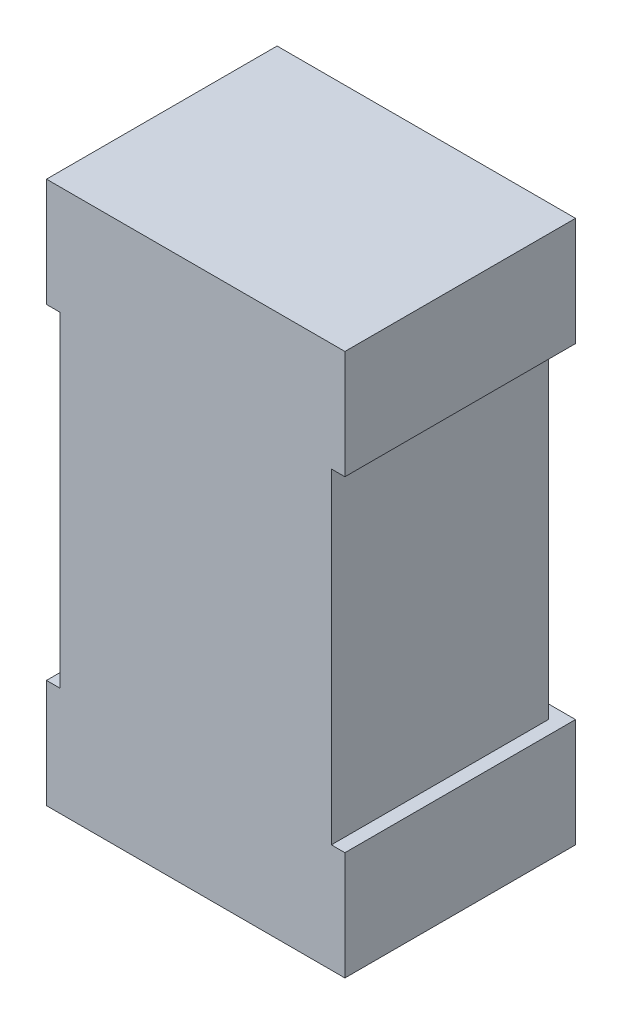
ISO-10303-21;
HEADER;
FILE_DESCRIPTION(('STEP AP214'),'2;1');
FILE_NAME('part.step','',(''),(''),'','','');
FILE_SCHEMA(('AUTOMOTIVE_DESIGN { 1 0 10303 214 1 1 1 1 }'));
ENDSEC;
DATA;
#1=APPLICATION_CONTEXT('core data for automotive mechanical design processes');
#2=APPLICATION_PROTOCOL_DEFINITION('international standard','automotive_design',2000,#1);
#3=PRODUCT_CONTEXT('',#1,'mechanical');
#4=PRODUCT('Part','Part','',(#3));
#5=PRODUCT_RELATED_PRODUCT_CATEGORY('part','',(#4));
#6=PRODUCT_DEFINITION_FORMATION('','',#4);
#7=PRODUCT_DEFINITION_CONTEXT('part definition',#1,'design');
#8=PRODUCT_DEFINITION('design','',#6,#7);
#9=PRODUCT_DEFINITION_SHAPE('','',#8);
#10=(LENGTH_UNIT() NAMED_UNIT(*) SI_UNIT(.MILLI.,.METRE.));
#11=(NAMED_UNIT(*) PLANE_ANGLE_UNIT() SI_UNIT($,.RADIAN.));
#12=(NAMED_UNIT(*) SI_UNIT($,.STERADIAN.) SOLID_ANGLE_UNIT());
#13=UNCERTAINTY_MEASURE_WITH_UNIT(LENGTH_MEASURE(1.E-05),#10,'distance_accuracy_value','');
#14=(GEOMETRIC_REPRESENTATION_CONTEXT(3) GLOBAL_UNCERTAINTY_ASSIGNED_CONTEXT((#13)) GLOBAL_UNIT_ASSIGNED_CONTEXT((#10,
#11,#12)) REPRESENTATION_CONTEXT('',''));
#15=CARTESIAN_POINT('',(0.,0.,0.));
#16=DIRECTION('',(0.,0.,1.));
#17=DIRECTION('',(1.,0.,0.));
#18=AXIS2_PLACEMENT_3D('',#15,#16,#17);
#19=CARTESIAN_POINT('',(5.149,2.401,-7.85));
#20=DIRECTION('',(0.,0.,-1.));
#21=DIRECTION('',(1.,0.,0.));
#22=AXIS2_PLACEMENT_3D('',#19,#20,#21);
#23=PLANE('',#22);
#24=DIRECTION('',(0.,-1.,0.));
#25=VECTOR('',#24,1.);
#26=CARTESIAN_POINT('',(5.15,2.2,-7.85));
#27=LINE('',#26,#25);
#28=CARTESIAN_POINT('',(5.15,2.4,-7.85));
#29=VERTEX_POINT('',#28);
#30=CARTESIAN_POINT('',(5.15,2.,-7.85));
#31=VERTEX_POINT('',#30);
#32=EDGE_CURVE('E117',#29,#31,#27,.T.);
#33=ORIENTED_EDGE('',*,*,#32,.F.);
#34=DIRECTION('',(-1.,0.,0.));
#35=VECTOR('',#34,1.);
#36=CARTESIAN_POINT('',(5.7,2.4,-7.85));
#37=LINE('',#36,#35);
#38=CARTESIAN_POINT('',(6.25,2.4,-7.85));
#39=VERTEX_POINT('',#38);
#40=EDGE_CURVE('E104',#39,#29,#37,.T.);
#41=ORIENTED_EDGE('',*,*,#40,.F.);
#42=DIRECTION('',(0.,1.,0.));
#43=VECTOR('',#42,1.);
#44=CARTESIAN_POINT('',(6.25,2.2,-7.85));
#45=LINE('',#44,#43);
#46=CARTESIAN_POINT('',(6.25,2.,-7.85));
#47=VERTEX_POINT('',#46);
#48=EDGE_CURVE('E21',#47,#39,#45,.T.);
#49=ORIENTED_EDGE('',*,*,#48,.F.);
#50=DIRECTION('',(1.,0.,0.));
#51=VECTOR('',#50,1.);
#52=CARTESIAN_POINT('',(5.7,2.,-7.85));
#53=LINE('',#52,#51);
#54=EDGE_CURVE('E131',#31,#47,#53,.T.);
#55=ORIENTED_EDGE('',*,*,#54,.F.);
#56=EDGE_LOOP('',(#33,#41,#49,#55));
#57=FACE_BOUND('',#56,.T.);
#58=ADVANCED_FACE('F17',(#57),#23,.T.);
#59=CARTESIAN_POINT('',(6.25,2.401,-6.999));
#60=DIRECTION('',(1.,0.,0.));
#61=DIRECTION('',(0.,-1.,0.));
#62=AXIS2_PLACEMENT_3D('',#59,#60,#61);
#63=PLANE('',#62);
#64=DIRECTION('',(0.,0.,-1.));
#65=VECTOR('',#64,1.);
#66=CARTESIAN_POINT('',(6.25,2.4,-7.425));
#67=LINE('',#66,#65);
#68=CARTESIAN_POINT('',(6.25,2.4,-7.));
#69=VERTEX_POINT('',#68);
#70=EDGE_CURVE('E111',#69,#39,#67,.T.);
#71=ORIENTED_EDGE('',*,*,#70,.F.);
#72=DIRECTION('',(0.,1.,0.));
#73=VECTOR('',#72,1.);
#74=CARTESIAN_POINT('',(6.25,1.4,-7.));
#75=LINE('',#74,#73);
#76=CARTESIAN_POINT('',(6.25,2.,-7.));
#77=VERTEX_POINT('',#76);
#78=EDGE_CURVE('E151',#77,#69,#75,.T.);
#79=ORIENTED_EDGE('',*,*,#78,.F.);
#80=DIRECTION('',(0.,0.,1.));
#81=VECTOR('',#80,1.);
#82=CARTESIAN_POINT('',(6.25,2.,-7.425));
#83=LINE('',#82,#81);
#84=EDGE_CURVE('E113',#47,#77,#83,.T.);
#85=ORIENTED_EDGE('',*,*,#84,.F.);
#86=ORIENTED_EDGE('',*,*,#48,.T.);
#87=EDGE_LOOP('',(#71,#79,#85,#86));
#88=FACE_BOUND('',#87,.T.);
#89=ADVANCED_FACE('F109',(#88),#63,.T.);
#90=CARTESIAN_POINT('',(5.149,2.4,-6.999));
#91=DIRECTION('',(0.,1.,0.));
#92=DIRECTION('',(1.,0.,0.));
#93=AXIS2_PLACEMENT_3D('',#90,#91,#92);
#94=PLANE('',#93);
#95=ORIENTED_EDGE('',*,*,#70,.T.);
#96=ORIENTED_EDGE('',*,*,#40,.T.);
#97=DIRECTION('',(0.,0.,-1.));
#98=VECTOR('',#97,1.);
#99=CARTESIAN_POINT('',(5.15,2.4,-7.425));
#100=LINE('',#99,#98);
#101=CARTESIAN_POINT('',(5.15,2.4,-7.));
#102=VERTEX_POINT('',#101);
#103=EDGE_CURVE('E119',#102,#29,#100,.T.);
#104=ORIENTED_EDGE('',*,*,#103,.F.);
#105=DIRECTION('',(-1.,0.,0.));
#106=VECTOR('',#105,1.);
#107=CARTESIAN_POINT('',(5.7,2.4,-7.));
#108=LINE('',#107,#106);
#109=EDGE_CURVE('E123',#69,#102,#108,.T.);
#110=ORIENTED_EDGE('',*,*,#109,.F.);
#111=EDGE_LOOP('',(#95,#96,#104,#110));
#112=FACE_BOUND('',#111,.T.);
#113=ADVANCED_FACE('F121',(#112),#94,.T.);
#114=CARTESIAN_POINT('',(5.15,1.999,-6.999));
#115=DIRECTION('',(-1.,0.,0.));
#116=DIRECTION('',(0.,1.,0.));
#117=AXIS2_PLACEMENT_3D('',#114,#115,#116);
#118=PLANE('',#117);
#119=ORIENTED_EDGE('',*,*,#103,.T.);
#120=ORIENTED_EDGE('',*,*,#32,.T.);
#121=DIRECTION('',(0.,0.,-1.));
#122=VECTOR('',#121,1.);
#123=CARTESIAN_POINT('',(5.15,2.,-7.425));
#124=LINE('',#123,#122);
#125=CARTESIAN_POINT('',(5.15,2.,-7.));
#126=VERTEX_POINT('',#125);
#127=EDGE_CURVE('E128',#126,#31,#124,.T.);
#128=ORIENTED_EDGE('',*,*,#127,.F.);
#129=DIRECTION('',(0.,-1.,0.));
#130=VECTOR('',#129,1.);
#131=CARTESIAN_POINT('',(5.15,1.4,-7.));
#132=LINE('',#131,#130);
#133=EDGE_CURVE('E154',#102,#126,#132,.T.);
#134=ORIENTED_EDGE('',*,*,#133,.F.);
#135=EDGE_LOOP('',(#119,#120,#128,#134));
#136=FACE_BOUND('',#135,.T.);
#137=ADVANCED_FACE('F306',(#136),#118,.T.);
#138=CARTESIAN_POINT('',(6.251,2.,-6.999));
#139=DIRECTION('',(0.,-1.,0.));
#140=DIRECTION('',(-1.,0.,0.));
#141=AXIS2_PLACEMENT_3D('',#138,#139,#140);
#142=PLANE('',#141);
#143=DIRECTION('',(1.,0.,0.));
#144=VECTOR('',#143,1.);
#145=CARTESIAN_POINT('',(5.7,2.,-7.8));
#146=LINE('',#145,#144);
#147=CARTESIAN_POINT('',(5.2,2.,-7.8));
#148=VERTEX_POINT('',#147);
#149=CARTESIAN_POINT('',(6.2,2.,-7.8));
#150=VERTEX_POINT('',#149);
#151=EDGE_CURVE('E137',#148,#150,#146,.T.);
#152=ORIENTED_EDGE('',*,*,#151,.F.);
#153=DIRECTION('',(0.,0.,-1.));
#154=VECTOR('',#153,1.);
#155=CARTESIAN_POINT('',(5.2,2.,-7.4));
#156=LINE('',#155,#154);
#157=CARTESIAN_POINT('',(5.2,2.,-7.));
#158=VERTEX_POINT('',#157);
#159=EDGE_CURVE('E134',#158,#148,#156,.T.);
#160=ORIENTED_EDGE('',*,*,#159,.F.);
#161=DIRECTION('',(1.,0.,0.));
#162=VECTOR('',#161,1.);
#163=CARTESIAN_POINT('',(5.7,2.,-7.));
#164=LINE('',#163,#162);
#165=EDGE_CURVE('E157',#126,#158,#164,.T.);
#166=ORIENTED_EDGE('',*,*,#165,.F.);
#167=ORIENTED_EDGE('',*,*,#127,.T.);
#168=ORIENTED_EDGE('',*,*,#54,.T.);
#169=ORIENTED_EDGE('',*,*,#84,.T.);
#170=DIRECTION('',(1.,0.,0.));
#171=VECTOR('',#170,1.);
#172=CARTESIAN_POINT('',(5.7,2.,-7.));
#173=LINE('',#172,#171);
#174=CARTESIAN_POINT('',(6.2,2.,-7.));
#175=VERTEX_POINT('',#174);
#176=EDGE_CURVE('E148',#175,#77,#173,.T.);
#177=ORIENTED_EDGE('',*,*,#176,.F.);
#178=DIRECTION('',(0.,0.,1.));
#179=VECTOR('',#178,1.);
#180=CARTESIAN_POINT('',(6.2,2.,-7.4));
#181=LINE('',#180,#179);
#182=EDGE_CURVE('E145',#150,#175,#181,.T.);
#183=ORIENTED_EDGE('',*,*,#182,.F.);
#184=EDGE_LOOP('',(#152,#160,#166,#167,#168,#169,#177,#183));
#185=FACE_BOUND('',#184,.T.);
#186=ADVANCED_FACE('F297',(#185),#142,.T.);
#187=CARTESIAN_POINT('',(5.2,0.799,-6.999));
#188=DIRECTION('',(-1.,0.,0.));
#189=DIRECTION('',(0.,1.,0.));
#190=AXIS2_PLACEMENT_3D('',#187,#188,#189);
#191=PLANE('',#190);
#192=DIRECTION('',(0.,-1.,0.));
#193=VECTOR('',#192,1.);
#194=CARTESIAN_POINT('',(5.2,1.4,-7.));
#195=LINE('',#194,#193);
#196=CARTESIAN_POINT('',(5.2,0.8,-7.));
#197=VERTEX_POINT('',#196);
#198=EDGE_CURVE('E160',#158,#197,#195,.T.);
#199=ORIENTED_EDGE('',*,*,#198,.F.);
#200=ORIENTED_EDGE('',*,*,#159,.T.);
#201=DIRECTION('',(0.,1.,0.));
#202=VECTOR('',#201,1.);
#203=CARTESIAN_POINT('',(5.2,1.4,-7.8));
#204=LINE('',#203,#202);
#205=CARTESIAN_POINT('',(5.2,0.8,-7.8));
#206=VERTEX_POINT('',#205);
#207=EDGE_CURVE('E139',#206,#148,#204,.T.);
#208=ORIENTED_EDGE('',*,*,#207,.F.);
#209=DIRECTION('',(0.,0.,-1.));
#210=VECTOR('',#209,1.);
#211=CARTESIAN_POINT('',(5.2,0.8,-7.425));
#212=LINE('',#211,#210);
#213=EDGE_CURVE('E173',#197,#206,#212,.T.);
#214=ORIENTED_EDGE('',*,*,#213,.F.);
#215=EDGE_LOOP('',(#199,#200,#208,#214));
#216=FACE_BOUND('',#215,.T.);
#217=ADVANCED_FACE('F217',(#216),#191,.T.);
#218=CARTESIAN_POINT('',(5.199,2.001,-7.8));
#219=DIRECTION('',(0.,0.,-1.));
#220=DIRECTION('',(1.,0.,0.));
#221=AXIS2_PLACEMENT_3D('',#218,#219,#220);
#222=PLANE('',#221);
#223=DIRECTION('',(1.,0.,0.));
#224=VECTOR('',#223,1.);
#225=CARTESIAN_POINT('',(5.7,0.8,-7.8));
#226=LINE('',#225,#224);
#227=CARTESIAN_POINT('',(6.2,0.8,-7.8));
#228=VERTEX_POINT('',#227);
#229=EDGE_CURVE('E176',#206,#228,#226,.T.);
#230=ORIENTED_EDGE('',*,*,#229,.F.);
#231=ORIENTED_EDGE('',*,*,#207,.T.);
#232=ORIENTED_EDGE('',*,*,#151,.T.);
#233=DIRECTION('',(0.,1.,0.));
#234=VECTOR('',#233,1.);
#235=CARTESIAN_POINT('',(6.2,1.4,-7.8));
#236=LINE('',#235,#234);
#237=EDGE_CURVE('E142',#228,#150,#236,.T.);
#238=ORIENTED_EDGE('',*,*,#237,.F.);
#239=EDGE_LOOP('',(#230,#231,#232,#238));
#240=FACE_BOUND('',#239,.T.);
#241=ADVANCED_FACE('F221',(#240),#222,.T.);
#242=CARTESIAN_POINT('',(6.2,2.001,-6.999));
#243=DIRECTION('',(1.,0.,0.));
#244=DIRECTION('',(0.,-1.,0.));
#245=AXIS2_PLACEMENT_3D('',#242,#243,#244);
#246=PLANE('',#245);
#247=DIRECTION('',(0.,1.,0.));
#248=VECTOR('',#247,1.);
#249=CARTESIAN_POINT('',(6.2,1.4,-7.));
#250=LINE('',#249,#248);
#251=CARTESIAN_POINT('',(6.2,0.8,-7.));
#252=VERTEX_POINT('',#251);
#253=EDGE_CURVE('E163',#252,#175,#250,.T.);
#254=ORIENTED_EDGE('',*,*,#253,.F.);
#255=DIRECTION('',(0.,0.,1.));
#256=VECTOR('',#255,1.);
#257=CARTESIAN_POINT('',(6.2,0.8,-7.425));
#258=LINE('',#257,#256);
#259=EDGE_CURVE('E179',#228,#252,#258,.T.);
#260=ORIENTED_EDGE('',*,*,#259,.F.);
#261=ORIENTED_EDGE('',*,*,#237,.T.);
#262=ORIENTED_EDGE('',*,*,#182,.T.);
#263=EDGE_LOOP('',(#254,#260,#261,#262));
#264=FACE_BOUND('',#263,.T.);
#265=ADVANCED_FACE('F224',(#264),#246,.T.);
#266=CARTESIAN_POINT('',(6.251,2.401,-7.));
#267=DIRECTION('',(0.,0.,1.));
#268=DIRECTION('',(-1.,0.,0.));
#269=AXIS2_PLACEMENT_3D('',#266,#267,#268);
#270=PLANE('',#269);
#271=DIRECTION('',(1.,0.,0.));
#272=VECTOR('',#271,1.);
#273=CARTESIAN_POINT('',(5.7,0.8,-7.));
#274=LINE('',#273,#272);
#275=CARTESIAN_POINT('',(6.25,0.8,-7.));
#276=VERTEX_POINT('',#275);
#277=EDGE_CURVE('E182',#252,#276,#274,.T.);
#278=ORIENTED_EDGE('',*,*,#277,.F.);
#279=ORIENTED_EDGE('',*,*,#253,.T.);
#280=ORIENTED_EDGE('',*,*,#176,.T.);
#281=ORIENTED_EDGE('',*,*,#78,.T.);
#282=ORIENTED_EDGE('',*,*,#109,.T.);
#283=ORIENTED_EDGE('',*,*,#133,.T.);
#284=ORIENTED_EDGE('',*,*,#165,.T.);
#285=ORIENTED_EDGE('',*,*,#198,.T.);
#286=DIRECTION('',(1.,0.,0.));
#287=VECTOR('',#286,1.);
#288=CARTESIAN_POINT('',(5.7,0.8,-7.));
#289=LINE('',#288,#287);
#290=CARTESIAN_POINT('',(5.15,0.8,-7.));
#291=VERTEX_POINT('',#290);
#292=EDGE_CURVE('E187',#291,#197,#289,.T.);
#293=ORIENTED_EDGE('',*,*,#292,.F.);
#294=DIRECTION('',(0.,1.,0.));
#295=VECTOR('',#294,1.);
#296=CARTESIAN_POINT('',(5.15,0.6,-7.));
#297=LINE('',#296,#295);
#298=CARTESIAN_POINT('',(5.15,0.4,-7.));
#299=VERTEX_POINT('',#298);
#300=EDGE_CURVE('E171',#299,#291,#297,.T.);
#301=ORIENTED_EDGE('',*,*,#300,.F.);
#302=DIRECTION('',(-1.,0.,0.));
#303=VECTOR('',#302,1.);
#304=CARTESIAN_POINT('',(5.7,0.4,-7.));
#305=LINE('',#304,#303);
#306=CARTESIAN_POINT('',(6.25,0.4,-7.));
#307=VERTEX_POINT('',#306);
#308=EDGE_CURVE('E166',#307,#299,#305,.T.);
#309=ORIENTED_EDGE('',*,*,#308,.F.);
#310=DIRECTION('',(0.,-1.,0.));
#311=VECTOR('',#310,1.);
#312=CARTESIAN_POINT('',(6.25,0.6,-7.));
#313=LINE('',#312,#311);
#314=EDGE_CURVE('E191',#276,#307,#313,.T.);
#315=ORIENTED_EDGE('',*,*,#314,.F.);
#316=EDGE_LOOP('',(#278,#279,#280,#281,#282,#283,#284,#285,#293,#301,#309,#315));
#317=FACE_BOUND('',#316,.T.);
#318=ADVANCED_FACE('F213',(#317),#270,.T.);
#319=CARTESIAN_POINT('',(6.251,0.4,-6.999));
#320=DIRECTION('',(0.,-1.,0.));
#321=DIRECTION('',(-1.,0.,0.));
#322=AXIS2_PLACEMENT_3D('',#319,#320,#321);
#323=PLANE('',#322);
#324=ORIENTED_EDGE('',*,*,#308,.T.);
#325=DIRECTION('',(0.,0.,1.));
#326=VECTOR('',#325,1.);
#327=CARTESIAN_POINT('',(5.15,0.4,-7.425));
#328=LINE('',#327,#326);
#329=CARTESIAN_POINT('',(5.15,0.4,-7.85));
#330=VERTEX_POINT('',#329);
#331=EDGE_CURVE('E168',#330,#299,#328,.T.);
#332=ORIENTED_EDGE('',*,*,#331,.F.);
#333=DIRECTION('',(-1.,0.,0.));
#334=VECTOR('',#333,1.);
#335=CARTESIAN_POINT('',(5.7,0.4,-7.85));
#336=LINE('',#335,#334);
#337=CARTESIAN_POINT('',(6.25,0.4,-7.85));
#338=VERTEX_POINT('',#337);
#339=EDGE_CURVE('E197',#338,#330,#336,.T.);
#340=ORIENTED_EDGE('',*,*,#339,.F.);
#341=DIRECTION('',(0.,0.,-1.));
#342=VECTOR('',#341,1.);
#343=CARTESIAN_POINT('',(6.25,0.4,-7.425));
#344=LINE('',#343,#342);
#345=EDGE_CURVE('E194',#307,#338,#344,.T.);
#346=ORIENTED_EDGE('',*,*,#345,.F.);
#347=EDGE_LOOP('',(#324,#332,#340,#346));
#348=FACE_BOUND('',#347,.T.);
#349=ADVANCED_FACE('F230',(#348),#323,.T.);
#350=CARTESIAN_POINT('',(5.15,0.399,-6.999));
#351=DIRECTION('',(-1.,0.,0.));
#352=DIRECTION('',(0.,1.,0.));
#353=AXIS2_PLACEMENT_3D('',#350,#351,#352);
#354=PLANE('',#353);
#355=DIRECTION('',(0.,0.,1.));
#356=VECTOR('',#355,1.);
#357=CARTESIAN_POINT('',(5.15,0.8,-7.425));
#358=LINE('',#357,#356);
#359=CARTESIAN_POINT('',(5.15,0.8,-7.85));
#360=VERTEX_POINT('',#359);
#361=EDGE_CURVE('E184',#360,#291,#358,.T.);
#362=ORIENTED_EDGE('',*,*,#361,.F.);
#363=DIRECTION('',(0.,1.,0.));
#364=VECTOR('',#363,1.);
#365=CARTESIAN_POINT('',(5.15,0.6,-7.85));
#366=LINE('',#365,#364);
#367=EDGE_CURVE('E200',#330,#360,#366,.T.);
#368=ORIENTED_EDGE('',*,*,#367,.F.);
#369=ORIENTED_EDGE('',*,*,#331,.T.);
#370=ORIENTED_EDGE('',*,*,#300,.T.);
#371=EDGE_LOOP('',(#362,#368,#369,#370));
#372=FACE_BOUND('',#371,.T.);
#373=ADVANCED_FACE('F209',(#372),#354,.T.);
#374=CARTESIAN_POINT('',(5.149,0.8,-6.999));
#375=DIRECTION('',(0.,1.,0.));
#376=DIRECTION('',(1.,0.,0.));
#377=AXIS2_PLACEMENT_3D('',#374,#375,#376);
#378=PLANE('',#377);
#379=ORIENTED_EDGE('',*,*,#361,.T.);
#380=ORIENTED_EDGE('',*,*,#292,.T.);
#381=ORIENTED_EDGE('',*,*,#213,.T.);
#382=ORIENTED_EDGE('',*,*,#229,.T.);
#383=ORIENTED_EDGE('',*,*,#259,.T.);
#384=ORIENTED_EDGE('',*,*,#277,.T.);
#385=DIRECTION('',(0.,0.,1.));
#386=VECTOR('',#385,1.);
#387=CARTESIAN_POINT('',(6.25,0.8,-7.425));
#388=LINE('',#387,#386);
#389=CARTESIAN_POINT('',(6.25,0.8,-7.85));
#390=VERTEX_POINT('',#389);
#391=EDGE_CURVE('E36',#390,#276,#388,.T.);
#392=ORIENTED_EDGE('',*,*,#391,.F.);
#393=DIRECTION('',(1.,0.,0.));
#394=VECTOR('',#393,1.);
#395=CARTESIAN_POINT('',(5.7,0.8,-7.85));
#396=LINE('',#395,#394);
#397=EDGE_CURVE('E27',#360,#390,#396,.T.);
#398=ORIENTED_EDGE('',*,*,#397,.F.);
#399=EDGE_LOOP('',(#379,#380,#381,#382,#383,#384,#392,#398));
#400=FACE_BOUND('',#399,.T.);
#401=ADVANCED_FACE('F206',(#400),#378,.T.);
#402=CARTESIAN_POINT('',(6.25,0.801,-6.999));
#403=DIRECTION('',(1.,0.,0.));
#404=DIRECTION('',(0.,-1.,0.));
#405=AXIS2_PLACEMENT_3D('',#402,#403,#404);
#406=PLANE('',#405);
#407=ORIENTED_EDGE('',*,*,#345,.T.);
#408=DIRECTION('',(0.,-1.,0.));
#409=VECTOR('',#408,1.);
#410=CARTESIAN_POINT('',(6.25,0.6,-7.85));
#411=LINE('',#410,#409);
#412=EDGE_CURVE('E11',#390,#338,#411,.T.);
#413=ORIENTED_EDGE('',*,*,#412,.F.);
#414=ORIENTED_EDGE('',*,*,#391,.T.);
#415=ORIENTED_EDGE('',*,*,#314,.T.);
#416=EDGE_LOOP('',(#407,#413,#414,#415));
#417=FACE_BOUND('',#416,.T.);
#418=ADVANCED_FACE('F228',(#417),#406,.T.);
#419=CARTESIAN_POINT('',(5.149,0.801,-7.85));
#420=DIRECTION('',(0.,0.,-1.));
#421=DIRECTION('',(1.,0.,0.));
#422=AXIS2_PLACEMENT_3D('',#419,#420,#421);
#423=PLANE('',#422);
#424=ORIENTED_EDGE('',*,*,#397,.T.);
#425=ORIENTED_EDGE('',*,*,#412,.T.);
#426=ORIENTED_EDGE('',*,*,#339,.T.);
#427=ORIENTED_EDGE('',*,*,#367,.T.);
#428=EDGE_LOOP('',(#424,#425,#426,#427));
#429=FACE_BOUND('',#428,.T.);
#430=ADVANCED_FACE('F19',(#429),#423,.T.);
#431=CLOSED_SHELL('',(#58,#89,#113,#137,#186,#217,#241,#265,#318,#349,#373,#401,#418,#430));
#432=MANIFOLD_SOLID_BREP('B1',#431);
#433=ADVANCED_BREP_SHAPE_REPRESENTATION('',(#18,#432),#14);
#434=SHAPE_DEFINITION_REPRESENTATION(#9,#433);
ENDSEC;
END-ISO-10303-21;
